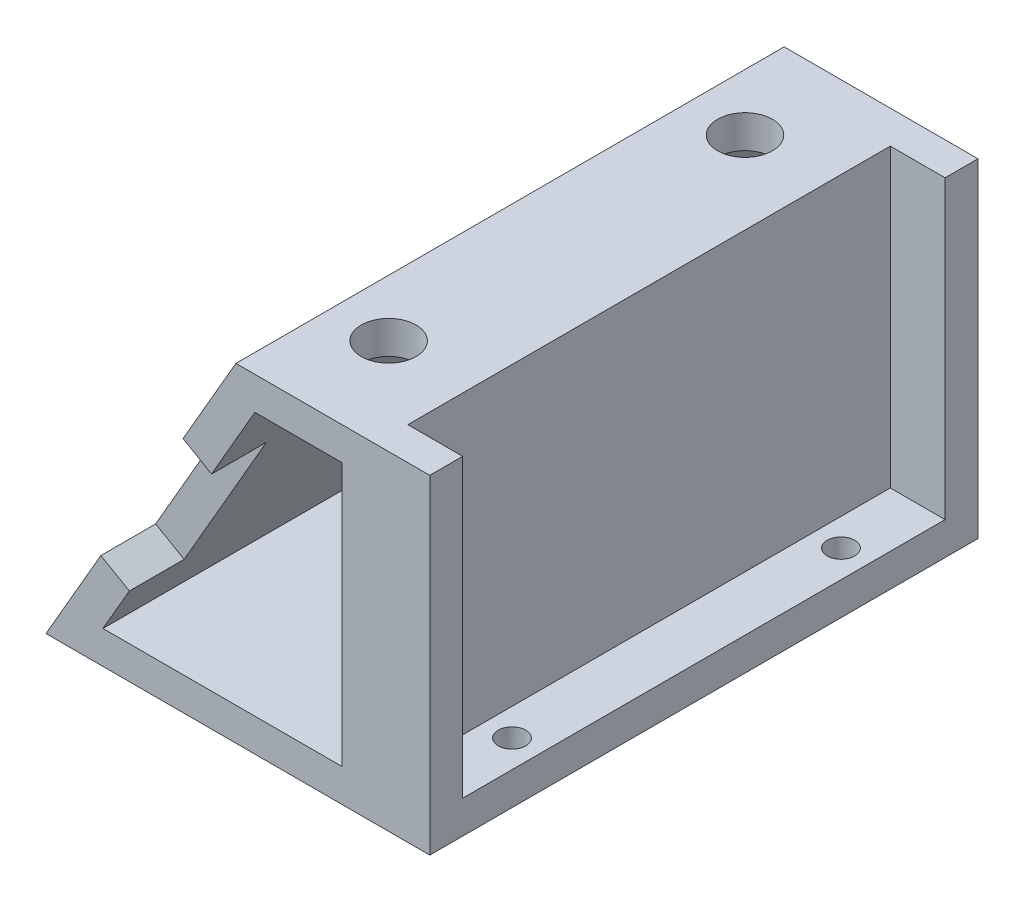
ISO-10303-21;
HEADER;
FILE_DESCRIPTION(('STEP AP214'),'2;1');
FILE_NAME('part.step','',(''),(''),'','','');
FILE_SCHEMA(('AUTOMOTIVE_DESIGN { 1 0 10303 214 1 1 1 1 }'));
ENDSEC;
DATA;
#1=APPLICATION_CONTEXT('core data for automotive mechanical design processes');
#2=APPLICATION_PROTOCOL_DEFINITION('international standard','automotive_design',2000,#1);
#3=PRODUCT_CONTEXT('',#1,'mechanical');
#4=PRODUCT('Part','Part','',(#3));
#5=PRODUCT_RELATED_PRODUCT_CATEGORY('part','',(#4));
#6=PRODUCT_DEFINITION_FORMATION('','',#4);
#7=PRODUCT_DEFINITION_CONTEXT('part definition',#1,'design');
#8=PRODUCT_DEFINITION('design','',#6,#7);
#9=PRODUCT_DEFINITION_SHAPE('','',#8);
#10=(LENGTH_UNIT() NAMED_UNIT(*) SI_UNIT(.MILLI.,.METRE.));
#11=(NAMED_UNIT(*) PLANE_ANGLE_UNIT() SI_UNIT($,.RADIAN.));
#12=(NAMED_UNIT(*) SI_UNIT($,.STERADIAN.) SOLID_ANGLE_UNIT());
#13=UNCERTAINTY_MEASURE_WITH_UNIT(LENGTH_MEASURE(1.E-05),#10,'distance_accuracy_value','');
#14=(GEOMETRIC_REPRESENTATION_CONTEXT(3) GLOBAL_UNCERTAINTY_ASSIGNED_CONTEXT((#13)) GLOBAL_UNIT_ASSIGNED_CONTEXT((#10,
#11,#12)) REPRESENTATION_CONTEXT('',''));
#15=CARTESIAN_POINT('',(0.,0.,0.));
#16=DIRECTION('',(0.,0.,1.));
#17=DIRECTION('',(1.,0.,0.));
#18=AXIS2_PLACEMENT_3D('',#15,#16,#17);
#19=CARTESIAN_POINT('',(1.00934572968318,-12.9498857474438,8.75));
#20=DIRECTION('',(0.,-1.,0.));
#21=DIRECTION('',(1.,0.,0.));
#22=AXIS2_PLACEMENT_3D('',#19,#20,#21);
#23=CYLINDRICAL_SURFACE('',#22,1.5);
#24=CARTESIAN_POINT('',(1.00934572968318,-15.9498857474438,8.75));
#25=DIRECTION('',(0.,-1.,0.));
#26=DIRECTION('',(1.,0.,0.));
#27=AXIS2_PLACEMENT_3D('',#24,#25,#26);
#28=CIRCLE('',#27,1.5);
#29=CARTESIAN_POINT('',(2.50934572968318,-15.9498857474438,8.75));
#30=VERTEX_POINT('',#29);
#31=EDGE_CURVE('E301',#30,#30,#28,.T.);
#32=ORIENTED_EDGE('',*,*,#31,.T.);
#33=EDGE_LOOP('',(#32));
#34=FACE_BOUND('',#33,.T.);
#35=CARTESIAN_POINT('',(1.00934572968318,-13.9498857474438,8.75));
#36=DIRECTION('',(0.,1.,0.));
#37=DIRECTION('',(-1.,0.,0.));
#38=AXIS2_PLACEMENT_3D('',#35,#36,#37);
#39=CIRCLE('',#38,1.5);
#40=CARTESIAN_POINT('',(-0.490654270316823,-13.9498857474438,8.75));
#41=VERTEX_POINT('',#40);
#42=EDGE_CURVE('E249',#41,#41,#39,.F.);
#43=ORIENTED_EDGE('',*,*,#42,.F.);
#44=EDGE_LOOP('',(#43));
#45=FACE_BOUND('',#44,.T.);
#46=ADVANCED_FACE('F35',(#34,#45),#23,.F.);
#47=CARTESIAN_POINT('',(1.00934572968317,-12.9498857474438,41.25));
#48=DIRECTION('',(0.,-1.,0.));
#49=DIRECTION('',(1.,0.,0.));
#50=AXIS2_PLACEMENT_3D('',#47,#48,#49);
#51=CYLINDRICAL_SURFACE('',#50,1.5);
#52=CARTESIAN_POINT('',(1.00934572968317,-15.9498857474438,41.25));
#53=DIRECTION('',(0.,-1.,0.));
#54=DIRECTION('',(1.,0.,0.));
#55=AXIS2_PLACEMENT_3D('',#52,#53,#54);
#56=CIRCLE('',#55,1.5);
#57=CARTESIAN_POINT('',(2.50934572968318,-15.9498857474438,41.25));
#58=VERTEX_POINT('',#57);
#59=EDGE_CURVE('E306',#58,#58,#56,.T.);
#60=ORIENTED_EDGE('',*,*,#59,.T.);
#61=EDGE_LOOP('',(#60));
#62=FACE_BOUND('',#61,.T.);
#63=CARTESIAN_POINT('',(1.00934572968317,-13.9498857474438,41.25));
#64=DIRECTION('',(0.,1.,0.));
#65=DIRECTION('',(-1.,0.,0.));
#66=AXIS2_PLACEMENT_3D('',#63,#64,#65);
#67=CIRCLE('',#66,1.5);
#68=CARTESIAN_POINT('',(-0.490654270316827,-13.9498857474438,41.25));
#69=VERTEX_POINT('',#68);
#70=EDGE_CURVE('E259',#69,#69,#67,.F.);
#71=ORIENTED_EDGE('',*,*,#70,.F.);
#72=EDGE_LOOP('',(#71));
#73=FACE_BOUND('',#72,.T.);
#74=ADVANCED_FACE('F406',(#62,#73),#51,.F.);
#75=CARTESIAN_POINT('',(5.50934572968318,0.,50.));
#76=DIRECTION('',(1.,0.,0.));
#77=DIRECTION('',(0.,1.,0.));
#78=AXIS2_PLACEMENT_3D('',#75,#76,#77);
#79=PLANE('',#78);
#80=DIRECTION('',(0.,-1.,0.));
#81=VECTOR('',#80,1.);
#82=CARTESIAN_POINT('',(5.50934572968318,0.,0.));
#83=LINE('',#82,#81);
#84=CARTESIAN_POINT('',(5.50934572968318,11.0501142525562,0.));
#85=VERTEX_POINT('',#84);
#86=CARTESIAN_POINT('',(5.50934572968318,-12.9498857474438,0.));
#87=VERTEX_POINT('',#86);
#88=EDGE_CURVE('E351',#85,#87,#83,.T.);
#89=ORIENTED_EDGE('',*,*,#88,.T.);
#90=DIRECTION('',(0.,0.,-1.));
#91=VECTOR('',#90,1.);
#92=CARTESIAN_POINT('',(5.50934572968318,-12.9498857474438,50.));
#93=LINE('',#92,#91);
#94=CARTESIAN_POINT('',(5.50934572968318,-12.9498857474438,50.));
#95=VERTEX_POINT('',#94);
#96=EDGE_CURVE('E11',#95,#87,#93,.T.);
#97=ORIENTED_EDGE('',*,*,#96,.F.);
#98=DIRECTION('',(0.,-1.,0.));
#99=VECTOR('',#98,1.);
#100=CARTESIAN_POINT('',(5.50934572968318,0.,50.));
#101=LINE('',#100,#99);
#102=CARTESIAN_POINT('',(5.50934572968318,11.0501142525562,50.));
#103=VERTEX_POINT('',#102);
#104=EDGE_CURVE('E327',#103,#95,#101,.T.);
#105=ORIENTED_EDGE('',*,*,#104,.F.);
#106=DIRECTION('',(0.,0.,-1.));
#107=VECTOR('',#106,1.);
#108=CARTESIAN_POINT('',(5.50934572968318,11.0501142525562,50.));
#109=LINE('',#108,#107);
#110=EDGE_CURVE('E359',#103,#85,#109,.T.);
#111=ORIENTED_EDGE('',*,*,#110,.T.);
#112=EDGE_LOOP('',(#89,#97,#105,#111));
#113=FACE_BOUND('',#112,.T.);
#114=ADVANCED_FACE('F413',(#113),#79,.F.);
#115=CARTESIAN_POINT('',(0.,-12.9498857474438,50.));
#116=DIRECTION('',(0.,-1.,0.));
#117=DIRECTION('',(1.,0.,0.));
#118=AXIS2_PLACEMENT_3D('',#115,#116,#117);
#119=PLANE('',#118);
#120=CARTESIAN_POINT('',(1.00934572968318,-12.9498857474438,8.75));
#121=DIRECTION('',(0.,-1.,0.));
#122=DIRECTION('',(1.,0.,0.));
#123=AXIS2_PLACEMENT_3D('',#120,#121,#122);
#124=CIRCLE('',#123,2.5);
#125=CARTESIAN_POINT('',(3.50934572968318,-12.9498857474438,8.75));
#126=VERTEX_POINT('',#125);
#127=EDGE_CURVE('E252',#126,#126,#124,.T.);
#128=ORIENTED_EDGE('',*,*,#127,.T.);
#129=EDGE_LOOP('',(#128));
#130=FACE_BOUND('',#129,.T.);
#131=CARTESIAN_POINT('',(1.00934572968318,-12.9498857474438,41.25));
#132=DIRECTION('',(0.,-1.,0.));
#133=DIRECTION('',(1.,0.,0.));
#134=AXIS2_PLACEMENT_3D('',#131,#132,#133);
#135=CIRCLE('',#134,2.5);
#136=CARTESIAN_POINT('',(3.50934572968318,-12.9498857474438,41.25));
#137=VERTEX_POINT('',#136);
#138=EDGE_CURVE('E262',#137,#137,#135,.T.);
#139=ORIENTED_EDGE('',*,*,#138,.T.);
#140=EDGE_LOOP('',(#139));
#141=FACE_BOUND('',#140,.T.);
#142=DIRECTION('',(-1.,0.,0.));
#143=VECTOR('',#142,1.);
#144=CARTESIAN_POINT('',(0.,-12.9498857474438,0.));
#145=LINE('',#144,#143);
#146=CARTESIAN_POINT('',(-16.2945018476102,-12.9498857474438,0.));
#147=VERTEX_POINT('',#146);
#148=EDGE_CURVE('E354',#87,#147,#145,.T.);
#149=ORIENTED_EDGE('',*,*,#148,.T.);
#150=DIRECTION('',(0.,0.,-1.));
#151=VECTOR('',#150,1.);
#152=CARTESIAN_POINT('',(-16.2945018476102,-12.9498857474438,50.));
#153=LINE('',#152,#151);
#154=CARTESIAN_POINT('',(-16.2945018476102,-12.9498857474438,50.));
#155=VERTEX_POINT('',#154);
#156=EDGE_CURVE('E44',#155,#147,#153,.T.);
#157=ORIENTED_EDGE('',*,*,#156,.F.);
#158=DIRECTION('',(-1.,0.,0.));
#159=VECTOR('',#158,1.);
#160=CARTESIAN_POINT('',(0.,-12.9498857474438,50.));
#161=LINE('',#160,#159);
#162=EDGE_CURVE('E330',#95,#155,#161,.T.);
#163=ORIENTED_EDGE('',*,*,#162,.F.);
#164=ORIENTED_EDGE('',*,*,#96,.T.);
#165=EDGE_LOOP('',(#149,#157,#163,#164));
#166=FACE_BOUND('',#165,.T.);
#167=ADVANCED_FACE('F437',(#130,#141,#166),#119,.F.);
#168=CARTESIAN_POINT('',(-6.61341136901155,3.81825483416052,50.));
#169=DIRECTION('',(-0.86602540378444,0.499999999999998,0.));
#170=DIRECTION('',(-0.499999999999998,-0.86602540378444,0.));
#171=AXIS2_PLACEMENT_3D('',#168,#169,#170);
#172=PLANE('',#171);
#173=CARTESIAN_POINT('',(-7.57206998327481,2.15780940714295,15.));
#174=DIRECTION('',(-0.86602540378444,0.499999999999998,0.));
#175=DIRECTION('',(-0.499999999999998,-0.86602540378444,0.));
#176=AXIS2_PLACEMENT_3D('',#173,#174,#175);
#177=CIRCLE('',#176,1.25);
#178=CARTESIAN_POINT('',(-8.19706998327481,1.0752776524124,15.));
#179=VERTEX_POINT('',#178);
#180=EDGE_CURVE('E234',#179,#179,#177,.T.);
#181=ORIENTED_EDGE('',*,*,#180,.T.);
#182=EDGE_LOOP('',(#181));
#183=FACE_BOUND('',#182,.T.);
#184=CARTESIAN_POINT('',(-7.57206998327482,2.15780940714295,35.));
#185=DIRECTION('',(-0.86602540378444,0.499999999999998,0.));
#186=DIRECTION('',(-0.499999999999998,-0.86602540378444,0.));
#187=AXIS2_PLACEMENT_3D('',#184,#185,#186);
#188=CIRCLE('',#187,1.25);
#189=CARTESIAN_POINT('',(-8.19706998327481,1.0752776524124,35.));
#190=VERTEX_POINT('',#189);
#191=EDGE_CURVE('E240',#190,#190,#188,.T.);
#192=ORIENTED_EDGE('',*,*,#191,.T.);
#193=EDGE_LOOP('',(#192));
#194=FACE_BOUND('',#193,.T.);
#195=DIRECTION('',(0.499999999999998,0.86602540378444,0.));
#196=VECTOR('',#195,1.);
#197=CARTESIAN_POINT('',(-6.39257805896357,4.20074934716723,5.));
#198=LINE('',#197,#196);
#199=CARTESIAN_POINT('',(-13.8925780589635,-8.78963170959937,5.));
#200=VERTEX_POINT('',#199);
#201=CARTESIAN_POINT('',(-6.39257805896357,4.20074934716723,5.));
#202=VERTEX_POINT('',#201);
#203=EDGE_CURVE('E184',#200,#202,#198,.T.);
#204=ORIENTED_EDGE('',*,*,#203,.T.);
#205=DIRECTION('',(0.,0.,-1.));
#206=VECTOR('',#205,1.);
#207=CARTESIAN_POINT('',(-6.39257805896357,4.20074934716723,0.));
#208=LINE('',#207,#206);
#209=CARTESIAN_POINT('',(-6.39257805896357,4.20074934716723,0.));
#210=VERTEX_POINT('',#209);
#211=EDGE_CURVE('E189',#202,#210,#208,.T.);
#212=ORIENTED_EDGE('',*,*,#211,.T.);
#213=DIRECTION('',(0.499999999999998,0.86602540378444,0.));
#214=VECTOR('',#213,1.);
#215=CARTESIAN_POINT('',(-6.61341136901155,3.81825483416052,0.));
#216=LINE('',#215,#214);
#217=CARTESIAN_POINT('',(-2.43809538705929,11.0501142525562,0.));
#218=VERTEX_POINT('',#217);
#219=EDGE_CURVE('E356',#210,#218,#216,.T.);
#220=ORIENTED_EDGE('',*,*,#219,.T.);
#221=DIRECTION('',(0.,0.,-1.));
#222=VECTOR('',#221,1.);
#223=CARTESIAN_POINT('',(-2.43809538705929,11.0501142525562,50.));
#224=LINE('',#223,#222);
#225=CARTESIAN_POINT('',(-2.43809538705929,11.0501142525562,50.));
#226=VERTEX_POINT('',#225);
#227=EDGE_CURVE('E362',#226,#218,#224,.T.);
#228=ORIENTED_EDGE('',*,*,#227,.F.);
#229=DIRECTION('',(0.499999999999998,0.86602540378444,0.));
#230=VECTOR('',#229,1.);
#231=CARTESIAN_POINT('',(-6.61341136901155,3.81825483416052,50.));
#232=LINE('',#231,#230);
#233=CARTESIAN_POINT('',(-6.39257805896357,4.20074934716723,50.));
#234=VERTEX_POINT('',#233);
#235=EDGE_CURVE('E332',#234,#226,#232,.T.);
#236=ORIENTED_EDGE('',*,*,#235,.F.);
#237=DIRECTION('',(0.,0.,-1.));
#238=VECTOR('',#237,1.);
#239=CARTESIAN_POINT('',(-6.39257805896357,4.20074934716723,45.));
#240=LINE('',#239,#238);
#241=CARTESIAN_POINT('',(-6.39257805896357,4.20074934716723,45.));
#242=VERTEX_POINT('',#241);
#243=EDGE_CURVE('E217',#234,#242,#240,.T.);
#244=ORIENTED_EDGE('',*,*,#243,.T.);
#245=DIRECTION('',(-0.499999999999998,-0.86602540378444,0.));
#246=VECTOR('',#245,1.);
#247=CARTESIAN_POINT('',(-6.39257805896357,4.20074934716723,45.));
#248=LINE('',#247,#246);
#249=CARTESIAN_POINT('',(-13.8925780589635,-8.78963170959937,45.));
#250=VERTEX_POINT('',#249);
#251=EDGE_CURVE('E210',#242,#250,#248,.T.);
#252=ORIENTED_EDGE('',*,*,#251,.T.);
#253=DIRECTION('',(0.,0.,1.));
#254=VECTOR('',#253,1.);
#255=CARTESIAN_POINT('',(-13.8925780589635,-8.78963170959937,45.));
#256=LINE('',#255,#254);
#257=CARTESIAN_POINT('',(-13.8925780589635,-8.78963170959937,50.));
#258=VERTEX_POINT('',#257);
#259=EDGE_CURVE('E213',#250,#258,#256,.T.);
#260=ORIENTED_EDGE('',*,*,#259,.T.);
#261=EDGE_CURVE('E333',#155,#258,#232,.T.);
#262=ORIENTED_EDGE('',*,*,#261,.F.);
#263=ORIENTED_EDGE('',*,*,#156,.T.);
#264=CARTESIAN_POINT('',(-13.8925780589635,-8.78963170959937,0.));
#265=VERTEX_POINT('',#264);
#266=EDGE_CURVE('E195',#147,#265,#216,.T.);
#267=ORIENTED_EDGE('',*,*,#266,.T.);
#268=DIRECTION('',(0.,0.,1.));
#269=VECTOR('',#268,1.);
#270=CARTESIAN_POINT('',(-13.8925780589635,-8.78963170959937,0.));
#271=LINE('',#270,#269);
#272=EDGE_CURVE('E52',#265,#200,#271,.T.);
#273=ORIENTED_EDGE('',*,*,#272,.T.);
#274=EDGE_LOOP('',(#204,#212,#220,#228,#236,#244,#252,#260,#262,#263,#267,#273));
#275=FACE_BOUND('',#274,.T.);
#276=ADVANCED_FACE('F192',(#183,#194,#275),#172,.F.);
#277=CARTESIAN_POINT('',(13.5093457296832,0.,50.));
#278=DIRECTION('',(1.,0.,0.));
#279=DIRECTION('',(0.,1.,0.));
#280=AXIS2_PLACEMENT_3D('',#277,#278,#279);
#281=PLANE('',#280);
#282=DIRECTION('',(0.,1.,0.));
#283=VECTOR('',#282,1.);
#284=CARTESIAN_POINT('',(13.5093457296832,-12.9498857474438,47.));
#285=LINE('',#284,#283);
#286=CARTESIAN_POINT('',(13.5093457296832,-12.9498857474438,47.));
#287=VERTEX_POINT('',#286);
#288=CARTESIAN_POINT('',(13.5093457296832,14.0501142525562,47.));
#289=VERTEX_POINT('',#288);
#290=EDGE_CURVE('E287',#287,#289,#285,.T.);
#291=ORIENTED_EDGE('',*,*,#290,.T.);
#292=DIRECTION('',(0.,0.,-1.));
#293=VECTOR('',#292,1.);
#294=CARTESIAN_POINT('',(13.5093457296832,14.0501142525562,50.));
#295=LINE('',#294,#293);
#296=CARTESIAN_POINT('',(13.5093457296832,14.0501142525562,50.));
#297=VERTEX_POINT('',#296);
#298=EDGE_CURVE('E363',#297,#289,#295,.T.);
#299=ORIENTED_EDGE('',*,*,#298,.F.);
#300=DIRECTION('',(0.,-1.,0.));
#301=VECTOR('',#300,1.);
#302=CARTESIAN_POINT('',(13.5093457296832,0.,50.));
#303=LINE('',#302,#301);
#304=CARTESIAN_POINT('',(13.5093457296832,-15.9498857474438,50.));
#305=VERTEX_POINT('',#304);
#306=EDGE_CURVE('E314',#297,#305,#303,.T.);
#307=ORIENTED_EDGE('',*,*,#306,.T.);
#308=DIRECTION('',(0.,0.,-1.));
#309=VECTOR('',#308,1.);
#310=CARTESIAN_POINT('',(13.5093457296832,-15.9498857474438,50.));
#311=LINE('',#310,#309);
#312=CARTESIAN_POINT('',(13.5093457296832,-15.9498857474438,0.));
#313=VERTEX_POINT('',#312);
#314=EDGE_CURVE('E338',#305,#313,#311,.T.);
#315=ORIENTED_EDGE('',*,*,#314,.T.);
#316=DIRECTION('',(0.,-1.,0.));
#317=VECTOR('',#316,1.);
#318=CARTESIAN_POINT('',(13.5093457296832,0.,0.));
#319=LINE('',#318,#317);
#320=CARTESIAN_POINT('',(13.5093457296832,14.0501142525562,0.));
#321=VERTEX_POINT('',#320);
#322=EDGE_CURVE('E313',#321,#313,#319,.T.);
#323=ORIENTED_EDGE('',*,*,#322,.F.);
#324=CARTESIAN_POINT('',(13.5093457296832,14.0501142525562,3.));
#325=VERTEX_POINT('',#324);
#326=EDGE_CURVE('E373',#325,#321,#295,.T.);
#327=ORIENTED_EDGE('',*,*,#326,.F.);
#328=DIRECTION('',(0.,1.,0.));
#329=VECTOR('',#328,1.);
#330=CARTESIAN_POINT('',(13.5093457296832,-12.9498857474438,3.));
#331=LINE('',#330,#329);
#332=CARTESIAN_POINT('',(13.5093457296832,-12.9498857474438,3.));
#333=VERTEX_POINT('',#332);
#334=EDGE_CURVE('E280',#333,#325,#331,.T.);
#335=ORIENTED_EDGE('',*,*,#334,.F.);
#336=DIRECTION('',(0.,0.,-1.));
#337=VECTOR('',#336,1.);
#338=CARTESIAN_POINT('',(13.5093457296832,-12.9498857474438,3.));
#339=LINE('',#338,#337);
#340=EDGE_CURVE('E267',#287,#333,#339,.T.);
#341=ORIENTED_EDGE('',*,*,#340,.F.);
#342=EDGE_LOOP('',(#291,#299,#307,#315,#323,#327,#335,#341));
#343=FACE_BOUND('',#342,.T.);
#344=ADVANCED_FACE('F37',(#343),#281,.T.);
#345=CARTESIAN_POINT('',(0.,14.0501142525562,50.));
#346=DIRECTION('',(0.,1.,0.));
#347=DIRECTION('',(-1.,0.,0.));
#348=AXIS2_PLACEMENT_3D('',#345,#346,#347);
#349=PLANE('',#348);
#350=CARTESIAN_POINT('',(1.00934572968317,14.0501142525562,8.75));
#351=DIRECTION('',(0.,1.,0.));
#352=DIRECTION('',(-1.,0.,0.));
#353=AXIS2_PLACEMENT_3D('',#350,#351,#352);
#354=CIRCLE('',#353,2.5);
#355=CARTESIAN_POINT('',(-1.49065427031683,14.0501142525562,8.75));
#356=VERTEX_POINT('',#355);
#357=EDGE_CURVE('E243',#356,#356,#354,.T.);
#358=ORIENTED_EDGE('',*,*,#357,.F.);
#359=EDGE_LOOP('',(#358));
#360=FACE_BOUND('',#359,.T.);
#361=CARTESIAN_POINT('',(1.00934572968317,14.0501142525562,41.25));
#362=DIRECTION('',(0.,1.,0.));
#363=DIRECTION('',(-1.,0.,0.));
#364=AXIS2_PLACEMENT_3D('',#361,#362,#363);
#365=CIRCLE('',#364,2.5);
#366=CARTESIAN_POINT('',(-1.49065427031683,14.0501142525562,41.25));
#367=VERTEX_POINT('',#366);
#368=EDGE_CURVE('E255',#367,#367,#365,.T.);
#369=ORIENTED_EDGE('',*,*,#368,.F.);
#370=EDGE_LOOP('',(#369));
#371=FACE_BOUND('',#370,.T.);
#372=DIRECTION('',(1.,0.,0.));
#373=VECTOR('',#372,1.);
#374=CARTESIAN_POINT('',(13.5093457296832,14.0501142525562,47.));
#375=LINE('',#374,#373);
#376=CARTESIAN_POINT('',(8.50934572968318,14.0501142525562,47.));
#377=VERTEX_POINT('',#376);
#378=EDGE_CURVE('E271',#377,#289,#375,.T.);
#379=ORIENTED_EDGE('',*,*,#378,.F.);
#380=DIRECTION('',(0.,0.,1.));
#381=VECTOR('',#380,1.);
#382=CARTESIAN_POINT('',(8.50934572968317,14.0501142525562,3.));
#383=LINE('',#382,#381);
#384=CARTESIAN_POINT('',(8.50934572968317,14.0501142525562,3.));
#385=VERTEX_POINT('',#384);
#386=EDGE_CURVE('E283',#385,#377,#383,.T.);
#387=ORIENTED_EDGE('',*,*,#386,.F.);
#388=DIRECTION('',(-1.,0.,0.));
#389=VECTOR('',#388,1.);
#390=CARTESIAN_POINT('',(13.5093457296832,14.0501142525562,3.));
#391=LINE('',#390,#389);
#392=EDGE_CURVE('E265',#325,#385,#391,.T.);
#393=ORIENTED_EDGE('',*,*,#392,.F.);
#394=ORIENTED_EDGE('',*,*,#326,.T.);
#395=DIRECTION('',(1.,0.,0.));
#396=VECTOR('',#395,1.);
#397=CARTESIAN_POINT('',(0.,14.0501142525562,0.));
#398=LINE('',#397,#396);
#399=CARTESIAN_POINT('',(-4.17014619462817,14.0501142525562,0.));
#400=VERTEX_POINT('',#399);
#401=EDGE_CURVE('E341',#400,#321,#398,.T.);
#402=ORIENTED_EDGE('',*,*,#401,.F.);
#403=DIRECTION('',(0.,0.,-1.));
#404=VECTOR('',#403,1.);
#405=CARTESIAN_POINT('',(-4.17014619462817,14.0501142525562,50.));
#406=LINE('',#405,#404);
#407=CARTESIAN_POINT('',(-4.17014619462817,14.0501142525562,50.));
#408=VERTEX_POINT('',#407);
#409=EDGE_CURVE('E370',#408,#400,#406,.T.);
#410=ORIENTED_EDGE('',*,*,#409,.F.);
#411=DIRECTION('',(1.,0.,0.));
#412=VECTOR('',#411,1.);
#413=CARTESIAN_POINT('',(0.,14.0501142525562,50.));
#414=LINE('',#413,#412);
#415=EDGE_CURVE('E317',#408,#297,#414,.T.);
#416=ORIENTED_EDGE('',*,*,#415,.T.);
#417=ORIENTED_EDGE('',*,*,#298,.T.);
#418=EDGE_LOOP('',(#379,#387,#393,#394,#402,#410,#416,#417));
#419=FACE_BOUND('',#418,.T.);
#420=ADVANCED_FACE('F450',(#360,#371,#419),#349,.T.);
#421=CARTESIAN_POINT('',(-9.21148758036487,5.31825483416052,50.));
#422=DIRECTION('',(-0.86602540378444,0.499999999999998,0.));
#423=DIRECTION('',(-0.499999999999998,-0.86602540378444,0.));
#424=AXIS2_PLACEMENT_3D('',#421,#422,#423);
#425=PLANE('',#424);
#426=DIRECTION('',(0.,0.,-1.));
#427=VECTOR('',#426,1.);
#428=CARTESIAN_POINT('',(-8.99065427031689,5.70074934716722,0.));
#429=LINE('',#428,#427);
#430=CARTESIAN_POINT('',(-8.99065427031689,5.70074934716722,5.));
#431=VERTEX_POINT('',#430);
#432=CARTESIAN_POINT('',(-8.99065427031689,5.70074934716722,0.));
#433=VERTEX_POINT('',#432);
#434=EDGE_CURVE('E196',#431,#433,#429,.T.);
#435=ORIENTED_EDGE('',*,*,#434,.F.);
#436=DIRECTION('',(0.499999999999998,0.86602540378444,0.));
#437=VECTOR('',#436,1.);
#438=CARTESIAN_POINT('',(-8.99065427031689,5.70074934716722,5.));
#439=LINE('',#438,#437);
#440=CARTESIAN_POINT('',(-16.4906542703169,-7.28963170959938,5.));
#441=VERTEX_POINT('',#440);
#442=EDGE_CURVE('E198',#441,#431,#439,.T.);
#443=ORIENTED_EDGE('',*,*,#442,.F.);
#444=DIRECTION('',(0.,0.,1.));
#445=VECTOR('',#444,1.);
#446=CARTESIAN_POINT('',(-16.4906542703169,-7.28963170959938,0.));
#447=LINE('',#446,#445);
#448=CARTESIAN_POINT('',(-16.4906542703169,-7.28963170959938,0.));
#449=VERTEX_POINT('',#448);
#450=EDGE_CURVE('E176',#449,#441,#447,.T.);
#451=ORIENTED_EDGE('',*,*,#450,.F.);
#452=DIRECTION('',(0.499999999999998,0.86602540378444,0.));
#453=VECTOR('',#452,1.);
#454=CARTESIAN_POINT('',(-9.21148758036487,5.31825483416052,0.));
#455=LINE('',#454,#453);
#456=CARTESIAN_POINT('',(-21.4906542703168,-15.9498857474438,0.));
#457=VERTEX_POINT('',#456);
#458=EDGE_CURVE('E345',#457,#449,#455,.T.);
#459=ORIENTED_EDGE('',*,*,#458,.F.);
#460=DIRECTION('',(0.,0.,-1.));
#461=VECTOR('',#460,1.);
#462=CARTESIAN_POINT('',(-21.4906542703168,-15.9498857474438,50.));
#463=LINE('',#462,#461);
#464=CARTESIAN_POINT('',(-21.4906542703168,-15.9498857474438,50.));
#465=VERTEX_POINT('',#464);
#466=EDGE_CURVE('E368',#465,#457,#463,.T.);
#467=ORIENTED_EDGE('',*,*,#466,.F.);
#468=DIRECTION('',(0.499999999999998,0.86602540378444,0.));
#469=VECTOR('',#468,1.);
#470=CARTESIAN_POINT('',(-9.21148758036487,5.31825483416052,50.));
#471=LINE('',#470,#469);
#472=CARTESIAN_POINT('',(-16.4906542703169,-7.28963170959938,50.));
#473=VERTEX_POINT('',#472);
#474=EDGE_CURVE('E322',#465,#473,#471,.T.);
#475=ORIENTED_EDGE('',*,*,#474,.T.);
#476=DIRECTION('',(0.,0.,1.));
#477=VECTOR('',#476,1.);
#478=CARTESIAN_POINT('',(-16.4906542703169,-7.28963170959938,45.));
#479=LINE('',#478,#477);
#480=CARTESIAN_POINT('',(-16.4906542703169,-7.28963170959938,45.));
#481=VERTEX_POINT('',#480);
#482=EDGE_CURVE('E60',#481,#473,#479,.T.);
#483=ORIENTED_EDGE('',*,*,#482,.F.);
#484=DIRECTION('',(-0.499999999999998,-0.86602540378444,0.));
#485=VECTOR('',#484,1.);
#486=CARTESIAN_POINT('',(-8.99065427031689,5.70074934716722,45.));
#487=LINE('',#486,#485);
#488=CARTESIAN_POINT('',(-8.99065427031689,5.70074934716722,45.));
#489=VERTEX_POINT('',#488);
#490=EDGE_CURVE('E207',#489,#481,#487,.T.);
#491=ORIENTED_EDGE('',*,*,#490,.F.);
#492=DIRECTION('',(0.,0.,-1.));
#493=VECTOR('',#492,1.);
#494=CARTESIAN_POINT('',(-8.99065427031689,5.70074934716722,45.));
#495=LINE('',#494,#493);
#496=CARTESIAN_POINT('',(-8.99065427031689,5.70074934716722,50.));
#497=VERTEX_POINT('',#496);
#498=EDGE_CURVE('E214',#497,#489,#495,.T.);
#499=ORIENTED_EDGE('',*,*,#498,.F.);
#500=EDGE_CURVE('E321',#497,#408,#471,.T.);
#501=ORIENTED_EDGE('',*,*,#500,.T.);
#502=ORIENTED_EDGE('',*,*,#409,.T.);
#503=EDGE_CURVE('E344',#433,#400,#455,.T.);
#504=ORIENTED_EDGE('',*,*,#503,.F.);
#505=EDGE_LOOP('',(#435,#443,#451,#459,#467,#475,#483,#491,#499,#501,#502,#504));
#506=FACE_BOUND('',#505,.T.);
#507=CARTESIAN_POINT('',(-10.1701461946281,3.65780940714294,15.));
#508=DIRECTION('',(-0.86602540378444,0.499999999999998,0.));
#509=DIRECTION('',(-0.499999999999998,-0.86602540378444,0.));
#510=AXIS2_PLACEMENT_3D('',#507,#508,#509);
#511=CIRCLE('',#510,1.25);
#512=CARTESIAN_POINT('',(-10.7951461946281,2.57527765241239,15.));
#513=VERTEX_POINT('',#512);
#514=EDGE_CURVE('E228',#513,#513,#511,.T.);
#515=ORIENTED_EDGE('',*,*,#514,.F.);
#516=EDGE_LOOP('',(#515));
#517=FACE_BOUND('',#516,.T.);
#518=CARTESIAN_POINT('',(-10.1701461946281,3.65780940714294,35.));
#519=DIRECTION('',(-0.86602540378444,0.499999999999998,0.));
#520=DIRECTION('',(-0.499999999999998,-0.86602540378444,0.));
#521=AXIS2_PLACEMENT_3D('',#518,#519,#520);
#522=CIRCLE('',#521,1.25);
#523=CARTESIAN_POINT('',(-10.7951461946281,2.57527765241239,35.));
#524=VERTEX_POINT('',#523);
#525=EDGE_CURVE('E237',#524,#524,#522,.T.);
#526=ORIENTED_EDGE('',*,*,#525,.F.);
#527=EDGE_LOOP('',(#526));
#528=FACE_BOUND('',#527,.T.);
#529=ADVANCED_FACE('F447',(#506,#517,#528),#425,.T.);
#530=CARTESIAN_POINT('',(0.,-15.9498857474438,50.));
#531=DIRECTION('',(0.,1.,0.));
#532=DIRECTION('',(-1.,0.,0.));
#533=AXIS2_PLACEMENT_3D('',#530,#531,#532);
#534=PLANE('',#533);
#535=CARTESIAN_POINT('',(11.0093457296832,-15.9498857474438,10.));
#536=DIRECTION('',(0.,-1.,0.));
#537=DIRECTION('',(1.,0.,0.));
#538=AXIS2_PLACEMENT_3D('',#535,#536,#537);
#539=CIRCLE('',#538,1.25);
#540=CARTESIAN_POINT('',(12.2593457296832,-15.9498857474438,10.));
#541=VERTEX_POINT('',#540);
#542=EDGE_CURVE('E302',#541,#541,#539,.T.);
#543=ORIENTED_EDGE('',*,*,#542,.F.);
#544=EDGE_LOOP('',(#543));
#545=FACE_BOUND('',#544,.T.);
#546=ORIENTED_EDGE('',*,*,#59,.F.);
#547=EDGE_LOOP('',(#546));
#548=FACE_BOUND('',#547,.T.);
#549=ORIENTED_EDGE('',*,*,#31,.F.);
#550=EDGE_LOOP('',(#549));
#551=FACE_BOUND('',#550,.T.);
#552=CARTESIAN_POINT('',(11.0093457296832,-15.9498857474438,40.));
#553=DIRECTION('',(0.,-1.,0.));
#554=DIRECTION('',(1.,0.,0.));
#555=AXIS2_PLACEMENT_3D('',#552,#553,#554);
#556=CIRCLE('',#555,1.25);
#557=CARTESIAN_POINT('',(12.2593457296832,-15.9498857474438,40.));
#558=VERTEX_POINT('',#557);
#559=EDGE_CURVE('E305',#558,#558,#556,.T.);
#560=ORIENTED_EDGE('',*,*,#559,.F.);
#561=EDGE_LOOP('',(#560));
#562=FACE_BOUND('',#561,.T.);
#563=DIRECTION('',(1.,0.,0.));
#564=VECTOR('',#563,1.);
#565=CARTESIAN_POINT('',(0.,-15.9498857474438,0.));
#566=LINE('',#565,#564);
#567=EDGE_CURVE('E348',#457,#313,#566,.T.);
#568=ORIENTED_EDGE('',*,*,#567,.T.);
#569=ORIENTED_EDGE('',*,*,#314,.F.);
#570=DIRECTION('',(1.,0.,0.));
#571=VECTOR('',#570,1.);
#572=CARTESIAN_POINT('',(0.,-15.9498857474438,50.));
#573=LINE('',#572,#571);
#574=EDGE_CURVE('E325',#465,#305,#573,.T.);
#575=ORIENTED_EDGE('',*,*,#574,.F.);
#576=ORIENTED_EDGE('',*,*,#466,.T.);
#577=EDGE_LOOP('',(#568,#569,#575,#576));
#578=FACE_BOUND('',#577,.T.);
#579=ADVANCED_FACE('F434',(#545,#548,#551,#562,#578),#534,.F.);
#580=CARTESIAN_POINT('',(0.,11.0501142525562,50.));
#581=DIRECTION('',(0.,1.,0.));
#582=DIRECTION('',(-1.,0.,0.));
#583=AXIS2_PLACEMENT_3D('',#580,#581,#582);
#584=PLANE('',#583);
#585=CARTESIAN_POINT('',(1.00934572968318,11.0501142525562,8.75));
#586=DIRECTION('',(0.,1.,0.));
#587=DIRECTION('',(-1.,0.,0.));
#588=AXIS2_PLACEMENT_3D('',#585,#586,#587);
#589=CIRCLE('',#588,2.5);
#590=CARTESIAN_POINT('',(-1.49065427031683,11.0501142525562,8.75));
#591=VERTEX_POINT('',#590);
#592=EDGE_CURVE('E39',#591,#591,#589,.T.);
#593=ORIENTED_EDGE('',*,*,#592,.T.);
#594=EDGE_LOOP('',(#593));
#595=FACE_BOUND('',#594,.T.);
#596=CARTESIAN_POINT('',(1.00934572968318,11.0501142525562,41.25));
#597=DIRECTION('',(0.,1.,0.));
#598=DIRECTION('',(-1.,0.,0.));
#599=AXIS2_PLACEMENT_3D('',#596,#597,#598);
#600=CIRCLE('',#599,2.5);
#601=CARTESIAN_POINT('',(-1.49065427031683,11.0501142525562,41.25));
#602=VERTEX_POINT('',#601);
#603=EDGE_CURVE('E266',#602,#602,#600,.T.);
#604=ORIENTED_EDGE('',*,*,#603,.T.);
#605=EDGE_LOOP('',(#604));
#606=FACE_BOUND('',#605,.T.);
#607=DIRECTION('',(1.,0.,0.));
#608=VECTOR('',#607,1.);
#609=CARTESIAN_POINT('',(0.,11.0501142525562,0.));
#610=LINE('',#609,#608);
#611=EDGE_CURVE('E318',#218,#85,#610,.T.);
#612=ORIENTED_EDGE('',*,*,#611,.T.);
#613=ORIENTED_EDGE('',*,*,#110,.F.);
#614=DIRECTION('',(1.,0.,0.));
#615=VECTOR('',#614,1.);
#616=CARTESIAN_POINT('',(0.,11.0501142525562,50.));
#617=LINE('',#616,#615);
#618=EDGE_CURVE('E336',#226,#103,#617,.T.);
#619=ORIENTED_EDGE('',*,*,#618,.F.);
#620=ORIENTED_EDGE('',*,*,#227,.T.);
#621=EDGE_LOOP('',(#612,#613,#619,#620));
#622=FACE_BOUND('',#621,.T.);
#623=ADVANCED_FACE('F385',(#595,#606,#622),#584,.F.);
#624=CARTESIAN_POINT('',(0.,0.,50.));
#625=DIRECTION('',(0.,0.,1.));
#626=DIRECTION('',(1.,0.,0.));
#627=AXIS2_PLACEMENT_3D('',#624,#625,#626);
#628=PLANE('',#627);
#629=DIRECTION('',(-0.86602540378444,0.499999999999998,0.));
#630=VECTOR('',#629,1.);
#631=CARTESIAN_POINT('',(-6.39257805896357,4.20074934716723,50.));
#632=LINE('',#631,#630);
#633=EDGE_CURVE('E229',#234,#497,#632,.T.);
#634=ORIENTED_EDGE('',*,*,#633,.F.);
#635=ORIENTED_EDGE('',*,*,#235,.T.);
#636=ORIENTED_EDGE('',*,*,#618,.T.);
#637=ORIENTED_EDGE('',*,*,#104,.T.);
#638=ORIENTED_EDGE('',*,*,#162,.T.);
#639=ORIENTED_EDGE('',*,*,#261,.T.);
#640=DIRECTION('',(-0.86602540378444,0.499999999999998,0.));
#641=VECTOR('',#640,1.);
#642=CARTESIAN_POINT('',(-13.8925780589635,-8.78963170959937,50.));
#643=LINE('',#642,#641);
#644=EDGE_CURVE('E231',#258,#473,#643,.T.);
#645=ORIENTED_EDGE('',*,*,#644,.T.);
#646=ORIENTED_EDGE('',*,*,#474,.F.);
#647=ORIENTED_EDGE('',*,*,#574,.T.);
#648=ORIENTED_EDGE('',*,*,#306,.F.);
#649=ORIENTED_EDGE('',*,*,#415,.F.);
#650=ORIENTED_EDGE('',*,*,#500,.F.);
#651=EDGE_LOOP('',(#634,#635,#636,#637,#638,#639,#645,#646,#647,#648,#649,#650));
#652=FACE_BOUND('',#651,.T.);
#653=ADVANCED_FACE('F425',(#652),#628,.T.);
#654=CARTESIAN_POINT('',(0.,0.,0.));
#655=DIRECTION('',(0.,0.,1.));
#656=DIRECTION('',(1.,0.,0.));
#657=AXIS2_PLACEMENT_3D('',#654,#655,#656);
#658=PLANE('',#657);
#659=ORIENTED_EDGE('',*,*,#219,.F.);
#660=DIRECTION('',(-0.86602540378444,0.499999999999998,0.));
#661=VECTOR('',#660,1.);
#662=CARTESIAN_POINT('',(-6.39257805896357,4.20074934716723,0.));
#663=LINE('',#662,#661);
#664=EDGE_CURVE('E204',#210,#433,#663,.T.);
#665=ORIENTED_EDGE('',*,*,#664,.T.);
#666=ORIENTED_EDGE('',*,*,#503,.T.);
#667=ORIENTED_EDGE('',*,*,#401,.T.);
#668=ORIENTED_EDGE('',*,*,#322,.T.);
#669=ORIENTED_EDGE('',*,*,#567,.F.);
#670=ORIENTED_EDGE('',*,*,#458,.T.);
#671=DIRECTION('',(-0.86602540378444,0.499999999999998,0.));
#672=VECTOR('',#671,1.);
#673=CARTESIAN_POINT('',(-13.8925780589635,-8.78963170959937,0.));
#674=LINE('',#673,#672);
#675=EDGE_CURVE('E181',#265,#449,#674,.T.);
#676=ORIENTED_EDGE('',*,*,#675,.F.);
#677=ORIENTED_EDGE('',*,*,#266,.F.);
#678=ORIENTED_EDGE('',*,*,#148,.F.);
#679=ORIENTED_EDGE('',*,*,#88,.F.);
#680=ORIENTED_EDGE('',*,*,#611,.F.);
#681=EDGE_LOOP('',(#659,#665,#666,#667,#668,#669,#670,#676,#677,#678,#679,#680));
#682=FACE_BOUND('',#681,.T.);
#683=ADVANCED_FACE('F423',(#682),#658,.F.);
#684=CARTESIAN_POINT('',(11.0093457296832,-12.9498857474438,40.));
#685=DIRECTION('',(0.,-1.,0.));
#686=DIRECTION('',(1.,0.,0.));
#687=AXIS2_PLACEMENT_3D('',#684,#685,#686);
#688=CYLINDRICAL_SURFACE('',#687,1.25);
#689=CARTESIAN_POINT('',(11.0093457296832,-12.9498857474438,40.));
#690=DIRECTION('',(0.,-1.,0.));
#691=DIRECTION('',(1.,0.,0.));
#692=AXIS2_PLACEMENT_3D('',#689,#690,#691);
#693=CIRCLE('',#692,1.25);
#694=CARTESIAN_POINT('',(12.2593457296832,-12.9498857474438,40.));
#695=VERTEX_POINT('',#694);
#696=EDGE_CURVE('E298',#695,#695,#693,.F.);
#697=ORIENTED_EDGE('',*,*,#696,.T.);
#698=EDGE_LOOP('',(#697));
#699=FACE_BOUND('',#698,.T.);
#700=ORIENTED_EDGE('',*,*,#559,.T.);
#701=EDGE_LOOP('',(#700));
#702=FACE_BOUND('',#701,.T.);
#703=ADVANCED_FACE('F419',(#699,#702),#688,.F.);
#704=CARTESIAN_POINT('',(11.0093457296832,-12.9498857474438,10.));
#705=DIRECTION('',(0.,-1.,0.));
#706=DIRECTION('',(1.,0.,0.));
#707=AXIS2_PLACEMENT_3D('',#704,#705,#706);
#708=CYLINDRICAL_SURFACE('',#707,1.25);
#709=CARTESIAN_POINT('',(11.0093457296832,-12.9498857474438,10.));
#710=DIRECTION('',(0.,-1.,0.));
#711=DIRECTION('',(1.,0.,0.));
#712=AXIS2_PLACEMENT_3D('',#709,#710,#711);
#713=CIRCLE('',#712,1.25);
#714=CARTESIAN_POINT('',(12.2593457296832,-12.9498857474438,10.));
#715=VERTEX_POINT('',#714);
#716=EDGE_CURVE('E290',#715,#715,#713,.F.);
#717=ORIENTED_EDGE('',*,*,#716,.T.);
#718=EDGE_LOOP('',(#717));
#719=FACE_BOUND('',#718,.T.);
#720=ORIENTED_EDGE('',*,*,#542,.T.);
#721=EDGE_LOOP('',(#720));
#722=FACE_BOUND('',#721,.T.);
#723=ADVANCED_FACE('F422',(#719,#722),#708,.F.);
#724=CARTESIAN_POINT('',(0.,-12.9498857474438,0.));
#725=DIRECTION('',(0.,-1.,0.));
#726=DIRECTION('',(1.,0.,0.));
#727=AXIS2_PLACEMENT_3D('',#724,#725,#726);
#728=PLANE('',#727);
#729=ORIENTED_EDGE('',*,*,#716,.F.);
#730=EDGE_LOOP('',(#729));
#731=FACE_BOUND('',#730,.T.);
#732=ORIENTED_EDGE('',*,*,#340,.T.);
#733=DIRECTION('',(-1.,0.,0.));
#734=VECTOR('',#733,1.);
#735=CARTESIAN_POINT('',(13.5093457296832,-12.9498857474438,3.));
#736=LINE('',#735,#734);
#737=CARTESIAN_POINT('',(8.50934572968318,-12.9498857474438,3.));
#738=VERTEX_POINT('',#737);
#739=EDGE_CURVE('E270',#333,#738,#736,.T.);
#740=ORIENTED_EDGE('',*,*,#739,.T.);
#741=DIRECTION('',(0.,0.,1.));
#742=VECTOR('',#741,1.);
#743=CARTESIAN_POINT('',(8.50934572968318,-12.9498857474438,3.));
#744=LINE('',#743,#742);
#745=CARTESIAN_POINT('',(8.50934572968319,-12.9498857474438,47.));
#746=VERTEX_POINT('',#745);
#747=EDGE_CURVE('E274',#738,#746,#744,.T.);
#748=ORIENTED_EDGE('',*,*,#747,.T.);
#749=DIRECTION('',(1.,0.,0.));
#750=VECTOR('',#749,1.);
#751=CARTESIAN_POINT('',(13.5093457296832,-12.9498857474438,47.));
#752=LINE('',#751,#750);
#753=EDGE_CURVE('E277',#746,#287,#752,.T.);
#754=ORIENTED_EDGE('',*,*,#753,.T.);
#755=EDGE_LOOP('',(#732,#740,#748,#754));
#756=FACE_BOUND('',#755,.T.);
#757=ORIENTED_EDGE('',*,*,#696,.F.);
#758=EDGE_LOOP('',(#757));
#759=FACE_BOUND('',#758,.T.);
#760=ADVANCED_FACE('F473',(#731,#756,#759),#728,.F.);
#761=CARTESIAN_POINT('',(13.5093457296832,-12.9498857474438,47.));
#762=DIRECTION('',(0.,0.,1.));
#763=DIRECTION('',(1.,0.,0.));
#764=AXIS2_PLACEMENT_3D('',#761,#762,#763);
#765=PLANE('',#764);
#766=ORIENTED_EDGE('',*,*,#378,.T.);
#767=ORIENTED_EDGE('',*,*,#290,.F.);
#768=ORIENTED_EDGE('',*,*,#753,.F.);
#769=DIRECTION('',(0.,1.,0.));
#770=VECTOR('',#769,1.);
#771=CARTESIAN_POINT('',(8.50934572968319,-12.9498857474438,47.));
#772=LINE('',#771,#770);
#773=EDGE_CURVE('E291',#746,#377,#772,.T.);
#774=ORIENTED_EDGE('',*,*,#773,.T.);
#775=EDGE_LOOP('',(#766,#767,#768,#774));
#776=FACE_BOUND('',#775,.T.);
#777=ADVANCED_FACE('F466',(#776),#765,.F.);
#778=CARTESIAN_POINT('',(8.50934572968318,-12.9498857474438,3.));
#779=DIRECTION('',(-1.,0.,0.));
#780=DIRECTION('',(0.,-1.,0.));
#781=AXIS2_PLACEMENT_3D('',#778,#779,#780);
#782=PLANE('',#781);
#783=ORIENTED_EDGE('',*,*,#386,.T.);
#784=ORIENTED_EDGE('',*,*,#773,.F.);
#785=ORIENTED_EDGE('',*,*,#747,.F.);
#786=DIRECTION('',(0.,1.,0.));
#787=VECTOR('',#786,1.);
#788=CARTESIAN_POINT('',(8.50934572968318,-12.9498857474438,3.));
#789=LINE('',#788,#787);
#790=EDGE_CURVE('E293',#738,#385,#789,.T.);
#791=ORIENTED_EDGE('',*,*,#790,.T.);
#792=EDGE_LOOP('',(#783,#784,#785,#791));
#793=FACE_BOUND('',#792,.T.);
#794=ADVANCED_FACE('F477',(#793),#782,.F.);
#795=CARTESIAN_POINT('',(13.5093457296832,-12.9498857474438,3.));
#796=DIRECTION('',(0.,0.,-1.));
#797=DIRECTION('',(-1.,0.,0.));
#798=AXIS2_PLACEMENT_3D('',#795,#796,#797);
#799=PLANE('',#798);
#800=ORIENTED_EDGE('',*,*,#392,.T.);
#801=ORIENTED_EDGE('',*,*,#790,.F.);
#802=ORIENTED_EDGE('',*,*,#739,.F.);
#803=ORIENTED_EDGE('',*,*,#334,.T.);
#804=EDGE_LOOP('',(#800,#801,#802,#803));
#805=FACE_BOUND('',#804,.T.);
#806=ADVANCED_FACE('F479',(#805),#799,.F.);
#807=CARTESIAN_POINT('',(1.00934572968318,-13.9498857474438,41.25));
#808=DIRECTION('',(0.,1.,0.));
#809=DIRECTION('',(-1.,0.,0.));
#810=AXIS2_PLACEMENT_3D('',#807,#808,#809);
#811=PLANE('',#810);
#812=CARTESIAN_POINT('',(1.00934572968318,-13.9498857474438,41.25));
#813=DIRECTION('',(0.,1.,0.));
#814=DIRECTION('',(-1.,0.,0.));
#815=AXIS2_PLACEMENT_3D('',#812,#813,#814);
#816=CIRCLE('',#815,2.5);
#817=CARTESIAN_POINT('',(-1.49065427031682,-13.9498857474438,41.25));
#818=VERTEX_POINT('',#817);
#819=EDGE_CURVE('E256',#818,#818,#816,.T.);
#820=ORIENTED_EDGE('',*,*,#819,.T.);
#821=EDGE_LOOP('',(#820));
#822=FACE_BOUND('',#821,.T.);
#823=ORIENTED_EDGE('',*,*,#70,.T.);
#824=EDGE_LOOP('',(#823));
#825=FACE_BOUND('',#824,.T.);
#826=ADVANCED_FACE('F549',(#822,#825),#811,.T.);
#827=CARTESIAN_POINT('',(1.00934572968318,-13.9498857474438,41.25));
#828=DIRECTION('',(0.,1.,0.));
#829=DIRECTION('',(-1.,0.,0.));
#830=AXIS2_PLACEMENT_3D('',#827,#828,#829);
#831=CYLINDRICAL_SURFACE('',#830,2.5);
#832=ORIENTED_EDGE('',*,*,#819,.F.);
#833=EDGE_LOOP('',(#832));
#834=FACE_BOUND('',#833,.T.);
#835=ORIENTED_EDGE('',*,*,#138,.F.);
#836=EDGE_LOOP('',(#835));
#837=FACE_BOUND('',#836,.T.);
#838=ADVANCED_FACE('F539',(#834,#837),#831,.F.);
#839=ORIENTED_EDGE('',*,*,#368,.T.);
#840=EDGE_LOOP('',(#839));
#841=FACE_BOUND('',#840,.T.);
#842=ORIENTED_EDGE('',*,*,#603,.F.);
#843=EDGE_LOOP('',(#842));
#844=FACE_BOUND('',#843,.T.);
#845=ADVANCED_FACE('F534',(#841,#844),#831,.F.);
#846=CARTESIAN_POINT('',(1.00934572968318,-13.9498857474438,8.75));
#847=DIRECTION('',(0.,1.,0.));
#848=DIRECTION('',(-1.,0.,0.));
#849=AXIS2_PLACEMENT_3D('',#846,#847,#848);
#850=PLANE('',#849);
#851=CARTESIAN_POINT('',(1.00934572968318,-13.9498857474438,8.75));
#852=DIRECTION('',(0.,1.,0.));
#853=DIRECTION('',(-1.,0.,0.));
#854=AXIS2_PLACEMENT_3D('',#851,#852,#853);
#855=CIRCLE('',#854,2.5);
#856=CARTESIAN_POINT('',(-1.49065427031682,-13.9498857474438,8.75));
#857=VERTEX_POINT('',#856);
#858=EDGE_CURVE('E246',#857,#857,#855,.T.);
#859=ORIENTED_EDGE('',*,*,#858,.T.);
#860=EDGE_LOOP('',(#859));
#861=FACE_BOUND('',#860,.T.);
#862=ORIENTED_EDGE('',*,*,#42,.T.);
#863=EDGE_LOOP('',(#862));
#864=FACE_BOUND('',#863,.T.);
#865=ADVANCED_FACE('F401',(#861,#864),#850,.T.);
#866=CARTESIAN_POINT('',(1.00934572968318,-13.9498857474438,8.75));
#867=DIRECTION('',(0.,1.,0.));
#868=DIRECTION('',(-1.,0.,0.));
#869=AXIS2_PLACEMENT_3D('',#866,#867,#868);
#870=CYLINDRICAL_SURFACE('',#869,2.5);
#871=ORIENTED_EDGE('',*,*,#858,.F.);
#872=EDGE_LOOP('',(#871));
#873=FACE_BOUND('',#872,.T.);
#874=ORIENTED_EDGE('',*,*,#127,.F.);
#875=EDGE_LOOP('',(#874));
#876=FACE_BOUND('',#875,.T.);
#877=ADVANCED_FACE('F391',(#873,#876),#870,.F.);
#878=ORIENTED_EDGE('',*,*,#357,.T.);
#879=EDGE_LOOP('',(#878));
#880=FACE_BOUND('',#879,.T.);
#881=ORIENTED_EDGE('',*,*,#592,.F.);
#882=EDGE_LOOP('',(#881));
#883=FACE_BOUND('',#882,.T.);
#884=ADVANCED_FACE('F388',(#880,#883),#870,.F.);
#885=CARTESIAN_POINT('',(-7.57206998327482,2.15780940714295,35.));
#886=DIRECTION('',(-0.86602540378444,0.499999999999998,0.));
#887=DIRECTION('',(-0.499999999999998,-0.86602540378444,0.));
#888=AXIS2_PLACEMENT_3D('',#885,#886,#887);
#889=CYLINDRICAL_SURFACE('',#888,1.25);
#890=ORIENTED_EDGE('',*,*,#191,.F.);
#891=EDGE_LOOP('',(#890));
#892=FACE_BOUND('',#891,.T.);
#893=ORIENTED_EDGE('',*,*,#525,.T.);
#894=EDGE_LOOP('',(#893));
#895=FACE_BOUND('',#894,.T.);
#896=ADVANCED_FACE('F390',(#892,#895),#889,.F.);
#897=CARTESIAN_POINT('',(-7.57206998327481,2.15780940714295,15.));
#898=DIRECTION('',(-0.86602540378444,0.499999999999998,0.));
#899=DIRECTION('',(-0.499999999999998,-0.86602540378444,0.));
#900=AXIS2_PLACEMENT_3D('',#897,#898,#899);
#901=CYLINDRICAL_SURFACE('',#900,1.25);
#902=ORIENTED_EDGE('',*,*,#180,.F.);
#903=EDGE_LOOP('',(#902));
#904=FACE_BOUND('',#903,.T.);
#905=ORIENTED_EDGE('',*,*,#514,.T.);
#906=EDGE_LOOP('',(#905));
#907=FACE_BOUND('',#906,.T.);
#908=ADVANCED_FACE('F398',(#904,#907),#901,.F.);
#909=CARTESIAN_POINT('',(-6.39257805896357,4.20074934716723,45.));
#910=DIRECTION('',(0.,0.,-1.));
#911=DIRECTION('',(-1.,0.,0.));
#912=AXIS2_PLACEMENT_3D('',#909,#910,#911);
#913=PLANE('',#912);
#914=ORIENTED_EDGE('',*,*,#490,.T.);
#915=DIRECTION('',(-0.86602540378444,0.499999999999998,0.));
#916=VECTOR('',#915,1.);
#917=CARTESIAN_POINT('',(-13.8925780589635,-8.78963170959937,45.));
#918=LINE('',#917,#916);
#919=EDGE_CURVE('E220',#250,#481,#918,.T.);
#920=ORIENTED_EDGE('',*,*,#919,.F.);
#921=ORIENTED_EDGE('',*,*,#251,.F.);
#922=DIRECTION('',(-0.86602540378444,0.499999999999998,0.));
#923=VECTOR('',#922,1.);
#924=CARTESIAN_POINT('',(-6.39257805896357,4.20074934716723,45.));
#925=LINE('',#924,#923);
#926=EDGE_CURVE('E226',#242,#489,#925,.T.);
#927=ORIENTED_EDGE('',*,*,#926,.T.);
#928=EDGE_LOOP('',(#914,#920,#921,#927));
#929=FACE_BOUND('',#928,.T.);
#930=ADVANCED_FACE('F513',(#929),#913,.F.);
#931=CARTESIAN_POINT('',(-6.39257805896357,4.20074934716723,45.));
#932=DIRECTION('',(0.499999999999998,0.86602540378444,0.));
#933=DIRECTION('',(-0.86602540378444,0.499999999999998,0.));
#934=AXIS2_PLACEMENT_3D('',#931,#932,#933);
#935=PLANE('',#934);
#936=ORIENTED_EDGE('',*,*,#498,.T.);
#937=ORIENTED_EDGE('',*,*,#926,.F.);
#938=ORIENTED_EDGE('',*,*,#243,.F.);
#939=ORIENTED_EDGE('',*,*,#633,.T.);
#940=EDGE_LOOP('',(#936,#937,#938,#939));
#941=FACE_BOUND('',#940,.T.);
#942=ADVANCED_FACE('F509',(#941),#935,.F.);
#943=CARTESIAN_POINT('',(-13.8925780589635,-8.78963170959937,45.));
#944=DIRECTION('',(-0.499999999999998,-0.86602540378444,0.));
#945=DIRECTION('',(0.86602540378444,-0.499999999999998,0.));
#946=AXIS2_PLACEMENT_3D('',#943,#944,#945);
#947=PLANE('',#946);
#948=ORIENTED_EDGE('',*,*,#482,.T.);
#949=ORIENTED_EDGE('',*,*,#644,.F.);
#950=ORIENTED_EDGE('',*,*,#259,.F.);
#951=ORIENTED_EDGE('',*,*,#919,.T.);
#952=EDGE_LOOP('',(#948,#949,#950,#951));
#953=FACE_BOUND('',#952,.T.);
#954=ADVANCED_FACE('F515',(#953),#947,.F.);
#955=CARTESIAN_POINT('',(-6.39257805896357,4.20074934716723,0.));
#956=DIRECTION('',(0.499999999999998,0.86602540378444,0.));
#957=DIRECTION('',(-0.86602540378444,0.499999999999998,0.));
#958=AXIS2_PLACEMENT_3D('',#955,#956,#957);
#959=PLANE('',#958);
#960=ORIENTED_EDGE('',*,*,#434,.T.);
#961=ORIENTED_EDGE('',*,*,#664,.F.);
#962=ORIENTED_EDGE('',*,*,#211,.F.);
#963=DIRECTION('',(-0.86602540378444,0.499999999999998,0.));
#964=VECTOR('',#963,1.);
#965=CARTESIAN_POINT('',(-6.39257805896357,4.20074934716723,5.));
#966=LINE('',#965,#964);
#967=EDGE_CURVE('E180',#202,#431,#966,.T.);
#968=ORIENTED_EDGE('',*,*,#967,.T.);
#969=EDGE_LOOP('',(#960,#961,#962,#968));
#970=FACE_BOUND('',#969,.T.);
#971=ADVANCED_FACE('F497',(#970),#959,.F.);
#972=CARTESIAN_POINT('',(-6.39257805896357,4.20074934716723,5.));
#973=DIRECTION('',(0.,0.,1.));
#974=DIRECTION('',(0.,-1.,0.));
#975=AXIS2_PLACEMENT_3D('',#972,#973,#974);
#976=PLANE('',#975);
#977=ORIENTED_EDGE('',*,*,#442,.T.);
#978=ORIENTED_EDGE('',*,*,#967,.F.);
#979=ORIENTED_EDGE('',*,*,#203,.F.);
#980=DIRECTION('',(-0.86602540378444,0.499999999999998,0.));
#981=VECTOR('',#980,1.);
#982=CARTESIAN_POINT('',(-13.8925780589635,-8.78963170959937,5.));
#983=LINE('',#982,#981);
#984=EDGE_CURVE('E172',#200,#441,#983,.T.);
#985=ORIENTED_EDGE('',*,*,#984,.T.);
#986=EDGE_LOOP('',(#977,#978,#979,#985));
#987=FACE_BOUND('',#986,.T.);
#988=ADVANCED_FACE('F185',(#987),#976,.F.);
#989=CARTESIAN_POINT('',(-13.8925780589635,-8.78963170959937,0.));
#990=DIRECTION('',(-0.499999999999998,-0.86602540378444,0.));
#991=DIRECTION('',(0.86602540378444,-0.499999999999998,0.));
#992=AXIS2_PLACEMENT_3D('',#989,#990,#991);
#993=PLANE('',#992);
#994=ORIENTED_EDGE('',*,*,#450,.T.);
#995=ORIENTED_EDGE('',*,*,#984,.F.);
#996=ORIENTED_EDGE('',*,*,#272,.F.);
#997=ORIENTED_EDGE('',*,*,#675,.T.);
#998=EDGE_LOOP('',(#994,#995,#996,#997));
#999=FACE_BOUND('',#998,.T.);
#1000=ADVANCED_FACE('F174',(#999),#993,.F.);
#1001=CLOSED_SHELL('',(#46,#74,#114,#167,#276,#344,#420,#529,#579,#623,#653,#683,#703,#723,#760,
#777,#794,#806,#826,#838,#845,#865,#877,#884,#896,#908,#930,#942,#954,#971,#988,#1000));
#1002=MANIFOLD_SOLID_BREP('B2',#1001);
#1003=ADVANCED_BREP_SHAPE_REPRESENTATION('',(#18,#1002),#14);
#1004=SHAPE_DEFINITION_REPRESENTATION(#9,#1003);
ENDSEC;
END-ISO-10303-21;
